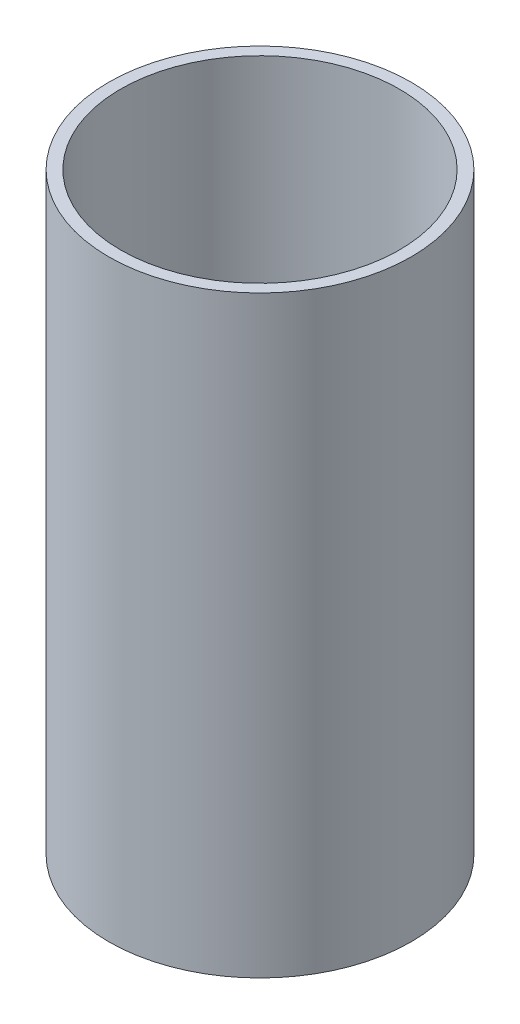
ISO-10303-21;
HEADER;
FILE_DESCRIPTION(('STEP AP214'),'2;1');
FILE_NAME('part.step','',(''),(''),'','','');
FILE_SCHEMA(('AUTOMOTIVE_DESIGN { 1 0 10303 214 1 1 1 1 }'));
ENDSEC;
DATA;
#1=APPLICATION_CONTEXT('core data for automotive mechanical design processes');
#2=APPLICATION_PROTOCOL_DEFINITION('international standard','automotive_design',2000,#1);
#3=PRODUCT_CONTEXT('',#1,'mechanical');
#4=PRODUCT('Part','Part','',(#3));
#5=PRODUCT_RELATED_PRODUCT_CATEGORY('part','',(#4));
#6=PRODUCT_DEFINITION_FORMATION('','',#4);
#7=PRODUCT_DEFINITION_CONTEXT('part definition',#1,'design');
#8=PRODUCT_DEFINITION('design','',#6,#7);
#9=PRODUCT_DEFINITION_SHAPE('','',#8);
#10=(LENGTH_UNIT() NAMED_UNIT(*) SI_UNIT(.MILLI.,.METRE.));
#11=(NAMED_UNIT(*) PLANE_ANGLE_UNIT() SI_UNIT($,.RADIAN.));
#12=(NAMED_UNIT(*) SI_UNIT($,.STERADIAN.) SOLID_ANGLE_UNIT());
#13=UNCERTAINTY_MEASURE_WITH_UNIT(LENGTH_MEASURE(1.E-05),#10,'distance_accuracy_value','');
#14=(GEOMETRIC_REPRESENTATION_CONTEXT(3) GLOBAL_UNCERTAINTY_ASSIGNED_CONTEXT((#13)) GLOBAL_UNIT_ASSIGNED_CONTEXT((#10,
#11,#12)) REPRESENTATION_CONTEXT('',''));
#15=CARTESIAN_POINT('',(0.,0.,0.));
#16=DIRECTION('',(0.,0.,1.));
#17=DIRECTION('',(1.,0.,0.));
#18=AXIS2_PLACEMENT_3D('',#15,#16,#17);
#19=CARTESIAN_POINT('',(0.,100.,0.));
#20=DIRECTION('',(0.,1.,0.));
#21=DIRECTION('',(0.,0.,1.));
#22=AXIS2_PLACEMENT_3D('',#19,#20,#21);
#23=PLANE('',#22);
#24=CARTESIAN_POINT('',(0.,100.,0.));
#25=DIRECTION('',(0.,1.,0.));
#26=DIRECTION('',(0.,0.,1.));
#27=AXIS2_PLACEMENT_3D('',#24,#25,#26);
#28=CIRCLE('',#27,25.5);
#29=CARTESIAN_POINT('',(0.,100.,25.5));
#30=VERTEX_POINT('',#29);
#31=EDGE_CURVE('E10',#30,#30,#28,.T.);
#32=ORIENTED_EDGE('',*,*,#31,.T.);
#33=EDGE_LOOP('',(#32));
#34=FACE_BOUND('',#33,.T.);
#35=CARTESIAN_POINT('',(0.,100.,0.));
#36=DIRECTION('',(0.,1.,0.));
#37=DIRECTION('',(0.,0.,1.));
#38=AXIS2_PLACEMENT_3D('',#35,#36,#37);
#39=CIRCLE('',#38,23.5);
#40=CARTESIAN_POINT('',(0.,100.,23.5));
#41=VERTEX_POINT('',#40);
#42=EDGE_CURVE('E46',#41,#41,#39,.T.);
#43=ORIENTED_EDGE('',*,*,#42,.F.);
#44=EDGE_LOOP('',(#43));
#45=FACE_BOUND('',#44,.T.);
#46=ADVANCED_FACE('F35',(#34,#45),#23,.T.);
#47=CARTESIAN_POINT('',(0.,0.,0.));
#48=DIRECTION('',(0.,1.,0.));
#49=DIRECTION('',(0.,0.,1.));
#50=AXIS2_PLACEMENT_3D('',#47,#48,#49);
#51=PLANE('',#50);
#52=CARTESIAN_POINT('',(0.,0.,0.));
#53=DIRECTION('',(0.,1.,0.));
#54=DIRECTION('',(0.,0.,1.));
#55=AXIS2_PLACEMENT_3D('',#52,#53,#54);
#56=CIRCLE('',#55,25.5);
#57=CARTESIAN_POINT('',(0.,0.,25.5));
#58=VERTEX_POINT('',#57);
#59=EDGE_CURVE('E39',#58,#58,#56,.T.);
#60=ORIENTED_EDGE('',*,*,#59,.F.);
#61=EDGE_LOOP('',(#60));
#62=FACE_BOUND('',#61,.T.);
#63=CARTESIAN_POINT('',(0.,0.,0.));
#64=DIRECTION('',(0.,1.,0.));
#65=DIRECTION('',(0.,0.,1.));
#66=AXIS2_PLACEMENT_3D('',#63,#64,#65);
#67=CIRCLE('',#66,23.5);
#68=CARTESIAN_POINT('',(0.,0.,23.5));
#69=VERTEX_POINT('',#68);
#70=EDGE_CURVE('E48',#69,#69,#67,.T.);
#71=ORIENTED_EDGE('',*,*,#70,.T.);
#72=EDGE_LOOP('',(#71));
#73=FACE_BOUND('',#72,.T.);
#74=ADVANCED_FACE('F58',(#62,#73),#51,.F.);
#75=CARTESIAN_POINT('',(0.,100.,0.));
#76=DIRECTION('',(0.,-1.,0.));
#77=DIRECTION('',(0.,0.,-1.));
#78=AXIS2_PLACEMENT_3D('',#75,#76,#77);
#79=CYLINDRICAL_SURFACE('',#78,25.5);
#80=ORIENTED_EDGE('',*,*,#31,.F.);
#81=EDGE_LOOP('',(#80));
#82=FACE_BOUND('',#81,.T.);
#83=ORIENTED_EDGE('',*,*,#59,.T.);
#84=EDGE_LOOP('',(#83));
#85=FACE_BOUND('',#84,.T.);
#86=ADVANCED_FACE('F37',(#82,#85),#79,.T.);
#87=CARTESIAN_POINT('',(0.,100.,0.));
#88=DIRECTION('',(0.,-1.,0.));
#89=DIRECTION('',(0.,0.,-1.));
#90=AXIS2_PLACEMENT_3D('',#87,#88,#89);
#91=CYLINDRICAL_SURFACE('',#90,23.5);
#92=ORIENTED_EDGE('',*,*,#42,.T.);
#93=EDGE_LOOP('',(#92));
#94=FACE_BOUND('',#93,.T.);
#95=ORIENTED_EDGE('',*,*,#70,.F.);
#96=EDGE_LOOP('',(#95));
#97=FACE_BOUND('',#96,.T.);
#98=ADVANCED_FACE('F54',(#94,#97),#91,.F.);
#99=CLOSED_SHELL('',(#46,#74,#86,#98));
#100=MANIFOLD_SOLID_BREP('B2',#99);
#101=ADVANCED_BREP_SHAPE_REPRESENTATION('',(#18,#100),#14);
#102=SHAPE_DEFINITION_REPRESENTATION(#9,#101);
ENDSEC;
END-ISO-10303-21;
